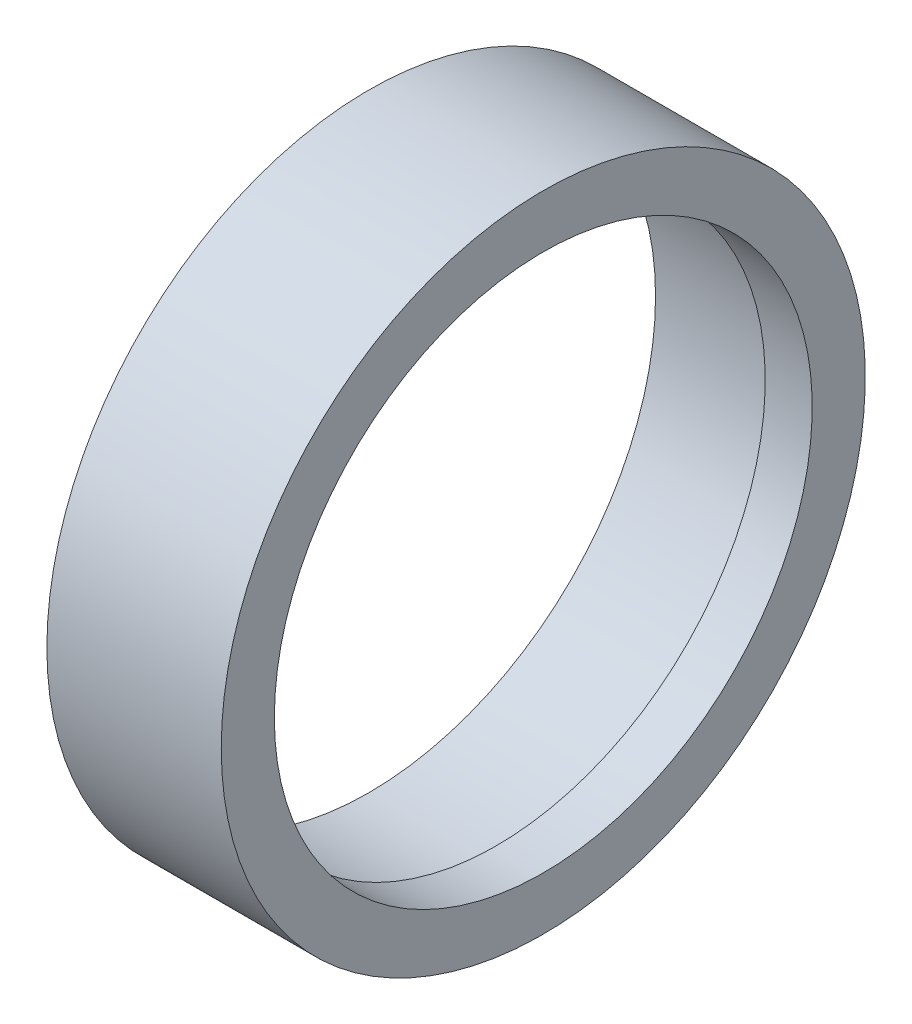
ISO-10303-21;
HEADER;
FILE_DESCRIPTION(('STEP AP214'),'2;1');
FILE_NAME('part.step','',(''),(''),'','','');
FILE_SCHEMA(('AUTOMOTIVE_DESIGN { 1 0 10303 214 1 1 1 1 }'));
ENDSEC;
DATA;
#1=APPLICATION_CONTEXT('core data for automotive mechanical design processes');
#2=APPLICATION_PROTOCOL_DEFINITION('international standard','automotive_design',2000,#1);
#3=PRODUCT_CONTEXT('',#1,'mechanical');
#4=PRODUCT('Part','Part','',(#3));
#5=PRODUCT_RELATED_PRODUCT_CATEGORY('part','',(#4));
#6=PRODUCT_DEFINITION_FORMATION('','',#4);
#7=PRODUCT_DEFINITION_CONTEXT('part definition',#1,'design');
#8=PRODUCT_DEFINITION('design','',#6,#7);
#9=PRODUCT_DEFINITION_SHAPE('','',#8);
#10=(LENGTH_UNIT() NAMED_UNIT(*) SI_UNIT(.MILLI.,.METRE.));
#11=(NAMED_UNIT(*) PLANE_ANGLE_UNIT() SI_UNIT($,.RADIAN.));
#12=(NAMED_UNIT(*) SI_UNIT($,.STERADIAN.) SOLID_ANGLE_UNIT());
#13=UNCERTAINTY_MEASURE_WITH_UNIT(LENGTH_MEASURE(1.E-05),#10,'distance_accuracy_value','');
#14=(GEOMETRIC_REPRESENTATION_CONTEXT(3) GLOBAL_UNCERTAINTY_ASSIGNED_CONTEXT((#13)) GLOBAL_UNIT_ASSIGNED_CONTEXT((#10,
#11,#12)) REPRESENTATION_CONTEXT('',''));
#15=CARTESIAN_POINT('',(0.,0.,0.));
#16=DIRECTION('',(0.,0.,1.));
#17=DIRECTION('',(1.,0.,0.));
#18=AXIS2_PLACEMENT_3D('',#15,#16,#17);
#19=CARTESIAN_POINT('',(14.6373022785946,0.,0.));
#20=DIRECTION('',(-1.,0.,0.));
#21=DIRECTION('',(0.,0.,1.));
#22=AXIS2_PLACEMENT_3D('',#19,#20,#21);
#23=PLANE('',#22);
#24=CARTESIAN_POINT('',(14.6373022785946,0.,0.));
#25=DIRECTION('',(-1.,0.,0.));
#26=DIRECTION('',(0.,0.,1.));
#27=AXIS2_PLACEMENT_3D('',#24,#25,#26);
#28=CIRCLE('',#27,38.);
#29=CARTESIAN_POINT('',(14.6373022785946,0.,38.));
#30=VERTEX_POINT('',#29);
#31=EDGE_CURVE('E51',#30,#30,#28,.T.);
#32=ORIENTED_EDGE('',*,*,#31,.T.);
#33=EDGE_LOOP('',(#32));
#34=FACE_BOUND('',#33,.T.);
#35=CARTESIAN_POINT('',(14.6373022785946,0.,0.));
#36=DIRECTION('',(-1.,0.,0.));
#37=DIRECTION('',(0.,0.,1.));
#38=AXIS2_PLACEMENT_3D('',#35,#36,#37);
#39=CIRCLE('',#38,45.5);
#40=CARTESIAN_POINT('',(14.6373022785946,0.,45.5));
#41=VERTEX_POINT('',#40);
#42=EDGE_CURVE('E45',#41,#41,#39,.T.);
#43=ORIENTED_EDGE('',*,*,#42,.F.);
#44=EDGE_LOOP('',(#43));
#45=FACE_BOUND('',#44,.T.);
#46=ADVANCED_FACE('F31',(#34,#45),#23,.F.);
#47=CARTESIAN_POINT('',(-10.,0.,-0.399999999999999));
#48=DIRECTION('',(-1.,0.,0.));
#49=DIRECTION('',(0.,0.,1.));
#50=AXIS2_PLACEMENT_3D('',#47,#48,#49);
#51=PLANE('',#50);
#52=CARTESIAN_POINT('',(-10.,0.,0.));
#53=DIRECTION('',(-1.,0.,0.));
#54=DIRECTION('',(0.,0.,1.));
#55=AXIS2_PLACEMENT_3D('',#52,#53,#54);
#56=CIRCLE('',#55,40.5);
#57=CARTESIAN_POINT('',(-10.,0.,40.5));
#58=VERTEX_POINT('',#57);
#59=EDGE_CURVE('E34',#58,#58,#56,.T.);
#60=ORIENTED_EDGE('',*,*,#59,.F.);
#61=EDGE_LOOP('',(#60));
#62=FACE_BOUND('',#61,.T.);
#63=CARTESIAN_POINT('',(-10.,0.,0.));
#64=DIRECTION('',(-1.,0.,0.));
#65=DIRECTION('',(0.,0.,1.));
#66=AXIS2_PLACEMENT_3D('',#63,#64,#65);
#67=CIRCLE('',#66,45.5);
#68=CARTESIAN_POINT('',(-10.,0.,45.5));
#69=VERTEX_POINT('',#68);
#70=EDGE_CURVE('E48',#69,#69,#67,.T.);
#71=ORIENTED_EDGE('',*,*,#70,.T.);
#72=EDGE_LOOP('',(#71));
#73=FACE_BOUND('',#72,.T.);
#74=ADVANCED_FACE('F73',(#62,#73),#51,.T.);
#75=CARTESIAN_POINT('',(8.,0.,0.));
#76=DIRECTION('',(-1.,0.,0.));
#77=DIRECTION('',(0.,0.,1.));
#78=AXIS2_PLACEMENT_3D('',#75,#76,#77);
#79=CYLINDRICAL_SURFACE('',#78,40.5);
#80=CARTESIAN_POINT('',(8.,0.,0.));
#81=DIRECTION('',(-1.,0.,0.));
#82=DIRECTION('',(0.,0.,1.));
#83=AXIS2_PLACEMENT_3D('',#80,#81,#82);
#84=CIRCLE('',#83,40.5);
#85=CARTESIAN_POINT('',(8.,0.,40.5));
#86=VERTEX_POINT('',#85);
#87=EDGE_CURVE('E10',#86,#86,#84,.T.);
#88=ORIENTED_EDGE('',*,*,#87,.F.);
#89=EDGE_LOOP('',(#88));
#90=FACE_BOUND('',#89,.T.);
#91=ORIENTED_EDGE('',*,*,#59,.T.);
#92=EDGE_LOOP('',(#91));
#93=FACE_BOUND('',#92,.T.);
#94=ADVANCED_FACE('F69',(#90,#93),#79,.F.);
#95=CARTESIAN_POINT('',(8.,0.,0.));
#96=DIRECTION('',(-1.,0.,0.));
#97=DIRECTION('',(0.,0.,1.));
#98=AXIS2_PLACEMENT_3D('',#95,#96,#97);
#99=PLANE('',#98);
#100=CARTESIAN_POINT('',(8.,0.,0.));
#101=DIRECTION('',(-1.,0.,0.));
#102=DIRECTION('',(0.,0.,1.));
#103=AXIS2_PLACEMENT_3D('',#100,#101,#102);
#104=CIRCLE('',#103,38.);
#105=CARTESIAN_POINT('',(8.,0.,38.));
#106=VERTEX_POINT('',#105);
#107=EDGE_CURVE('E41',#106,#106,#104,.T.);
#108=ORIENTED_EDGE('',*,*,#107,.F.);
#109=EDGE_LOOP('',(#108));
#110=FACE_BOUND('',#109,.T.);
#111=ORIENTED_EDGE('',*,*,#87,.T.);
#112=EDGE_LOOP('',(#111));
#113=FACE_BOUND('',#112,.T.);
#114=ADVANCED_FACE('F60',(#110,#113),#99,.T.);
#115=CARTESIAN_POINT('',(10.,0.,0.));
#116=DIRECTION('',(-1.,0.,0.));
#117=DIRECTION('',(0.,0.,1.));
#118=AXIS2_PLACEMENT_3D('',#115,#116,#117);
#119=CYLINDRICAL_SURFACE('',#118,38.);
#120=ORIENTED_EDGE('',*,*,#107,.T.);
#121=EDGE_LOOP('',(#120));
#122=FACE_BOUND('',#121,.T.);
#123=ORIENTED_EDGE('',*,*,#31,.F.);
#124=EDGE_LOOP('',(#123));
#125=FACE_BOUND('',#124,.T.);
#126=ADVANCED_FACE('F57',(#122,#125),#119,.F.);
#127=CARTESIAN_POINT('',(19.1845861212756,0.,0.));
#128=DIRECTION('',(-1.,0.,0.));
#129=DIRECTION('',(0.,0.,1.));
#130=AXIS2_PLACEMENT_3D('',#127,#128,#129);
#131=CYLINDRICAL_SURFACE('',#130,45.5);
#132=ORIENTED_EDGE('',*,*,#70,.F.);
#133=EDGE_LOOP('',(#132));
#134=FACE_BOUND('',#133,.T.);
#135=ORIENTED_EDGE('',*,*,#42,.T.);
#136=EDGE_LOOP('',(#135));
#137=FACE_BOUND('',#136,.T.);
#138=ADVANCED_FACE('F59',(#134,#137),#131,.T.);
#139=CLOSED_SHELL('',(#46,#74,#94,#114,#126,#138));
#140=MANIFOLD_SOLID_BREP('B2',#139);
#141=ADVANCED_BREP_SHAPE_REPRESENTATION('',(#18,#140),#14);
#142=SHAPE_DEFINITION_REPRESENTATION(#9,#141);
ENDSEC;
END-ISO-10303-21;
